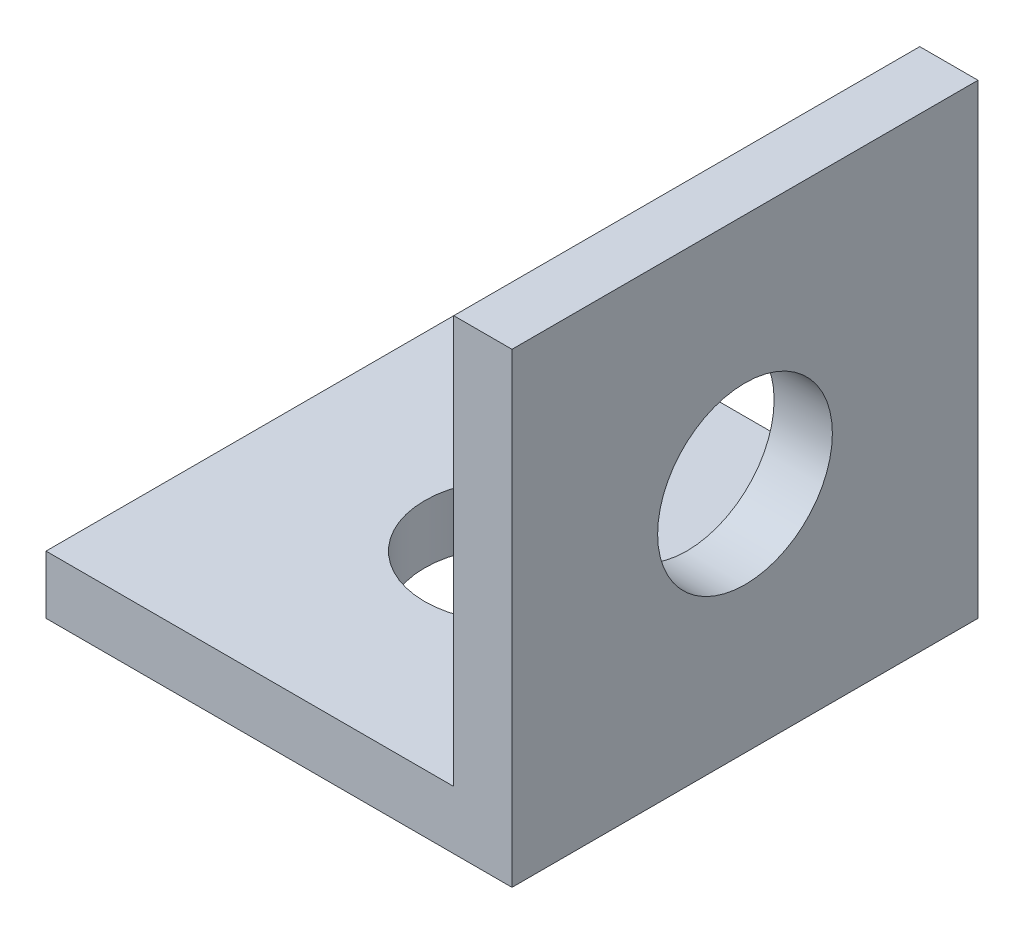
ISO-10303-21;
HEADER;
FILE_DESCRIPTION(('STEP AP214'),'2;1');
FILE_NAME('part.step','',(''),(''),'','','');
FILE_SCHEMA(('AUTOMOTIVE_DESIGN { 1 0 10303 214 1 1 1 1 }'));
ENDSEC;
DATA;
#1=APPLICATION_CONTEXT('core data for automotive mechanical design processes');
#2=APPLICATION_PROTOCOL_DEFINITION('international standard','automotive_design',2000,#1);
#3=PRODUCT_CONTEXT('',#1,'mechanical');
#4=PRODUCT('Part','Part','',(#3));
#5=PRODUCT_RELATED_PRODUCT_CATEGORY('part','',(#4));
#6=PRODUCT_DEFINITION_FORMATION('','',#4);
#7=PRODUCT_DEFINITION_CONTEXT('part definition',#1,'design');
#8=PRODUCT_DEFINITION('design','',#6,#7);
#9=PRODUCT_DEFINITION_SHAPE('','',#8);
#10=(LENGTH_UNIT() NAMED_UNIT(*) SI_UNIT(.MILLI.,.METRE.));
#11=(NAMED_UNIT(*) PLANE_ANGLE_UNIT() SI_UNIT($,.RADIAN.));
#12=(NAMED_UNIT(*) SI_UNIT($,.STERADIAN.) SOLID_ANGLE_UNIT());
#13=UNCERTAINTY_MEASURE_WITH_UNIT(LENGTH_MEASURE(1.E-05),#10,'distance_accuracy_value','');
#14=(GEOMETRIC_REPRESENTATION_CONTEXT(3) GLOBAL_UNCERTAINTY_ASSIGNED_CONTEXT((#13)) GLOBAL_UNIT_ASSIGNED_CONTEXT((#10,
#11,#12)) REPRESENTATION_CONTEXT('',''));
#15=CARTESIAN_POINT('',(0.,0.,0.));
#16=DIRECTION('',(0.,0.,1.));
#17=DIRECTION('',(1.,0.,0.));
#18=AXIS2_PLACEMENT_3D('',#15,#16,#17);
#19=CARTESIAN_POINT('',(0.,1.,-8.));
#20=DIRECTION('',(0.,-1.,0.));
#21=DIRECTION('',(0.,0.,-1.));
#22=AXIS2_PLACEMENT_3D('',#19,#20,#21);
#23=PLANE('',#22);
#24=CARTESIAN_POINT('',(4.,1.,-4.));
#25=DIRECTION('',(0.,1.,0.));
#26=DIRECTION('',(0.,0.,1.));
#27=AXIS2_PLACEMENT_3D('',#24,#25,#26);
#28=CIRCLE('',#27,1.5);
#29=CARTESIAN_POINT('',(4.,1.,-2.5));
#30=VERTEX_POINT('',#29);
#31=EDGE_CURVE('E95',#30,#30,#28,.T.);
#32=ORIENTED_EDGE('',*,*,#31,.F.);
#33=EDGE_LOOP('',(#32));
#34=FACE_BOUND('',#33,.T.);
#35=DIRECTION('',(0.,0.,1.));
#36=VECTOR('',#35,1.);
#37=CARTESIAN_POINT('',(7.,1.,0.));
#38=LINE('',#37,#36);
#39=CARTESIAN_POINT('',(7.,1.,-8.));
#40=VERTEX_POINT('',#39);
#41=CARTESIAN_POINT('',(7.,1.,0.));
#42=VERTEX_POINT('',#41);
#43=EDGE_CURVE('E48',#40,#42,#38,.T.);
#44=ORIENTED_EDGE('',*,*,#43,.F.);
#45=DIRECTION('',(-1.,0.,0.));
#46=VECTOR('',#45,1.);
#47=CARTESIAN_POINT('',(0.,1.,-8.));
#48=LINE('',#47,#46);
#49=CARTESIAN_POINT('',(0.,1.,-8.));
#50=VERTEX_POINT('',#49);
#51=EDGE_CURVE('E53',#40,#50,#48,.T.);
#52=ORIENTED_EDGE('',*,*,#51,.T.);
#53=DIRECTION('',(0.,0.,1.));
#54=VECTOR('',#53,1.);
#55=CARTESIAN_POINT('',(0.,1.,0.));
#56=LINE('',#55,#54);
#57=CARTESIAN_POINT('',(0.,1.,0.));
#58=VERTEX_POINT('',#57);
#59=EDGE_CURVE('E84',#50,#58,#56,.T.);
#60=ORIENTED_EDGE('',*,*,#59,.T.);
#61=DIRECTION('',(1.,0.,0.));
#62=VECTOR('',#61,1.);
#63=CARTESIAN_POINT('',(0.,1.,0.));
#64=LINE('',#63,#62);
#65=EDGE_CURVE('E109',#58,#42,#64,.T.);
#66=ORIENTED_EDGE('',*,*,#65,.T.);
#67=EDGE_LOOP('',(#44,#52,#60,#66));
#68=FACE_BOUND('',#67,.T.);
#69=ADVANCED_FACE('F31',(#34,#68),#23,.F.);
#70=CARTESIAN_POINT('',(0.,0.,-8.));
#71=DIRECTION('',(0.,-1.,0.));
#72=DIRECTION('',(0.,0.,-1.));
#73=AXIS2_PLACEMENT_3D('',#70,#71,#72);
#74=PLANE('',#73);
#75=DIRECTION('',(0.,0.,1.));
#76=VECTOR('',#75,1.);
#77=CARTESIAN_POINT('',(0.,0.,0.));
#78=LINE('',#77,#76);
#79=CARTESIAN_POINT('',(0.,0.,-8.));
#80=VERTEX_POINT('',#79);
#81=CARTESIAN_POINT('',(0.,0.,0.));
#82=VERTEX_POINT('',#81);
#83=EDGE_CURVE('E90',#80,#82,#78,.T.);
#84=ORIENTED_EDGE('',*,*,#83,.F.);
#85=DIRECTION('',(-1.,0.,0.));
#86=VECTOR('',#85,1.);
#87=CARTESIAN_POINT('',(0.,0.,-8.));
#88=LINE('',#87,#86);
#89=CARTESIAN_POINT('',(8.,0.,-8.));
#90=VERTEX_POINT('',#89);
#91=EDGE_CURVE('E73',#90,#80,#88,.T.);
#92=ORIENTED_EDGE('',*,*,#91,.F.);
#93=DIRECTION('',(0.,0.,-1.));
#94=VECTOR('',#93,1.);
#95=CARTESIAN_POINT('',(8.,0.,0.));
#96=LINE('',#95,#94);
#97=CARTESIAN_POINT('',(8.,0.,0.));
#98=VERTEX_POINT('',#97);
#99=EDGE_CURVE('E85',#98,#90,#96,.T.);
#100=ORIENTED_EDGE('',*,*,#99,.F.);
#101=DIRECTION('',(1.,0.,0.));
#102=VECTOR('',#101,1.);
#103=CARTESIAN_POINT('',(0.,0.,0.));
#104=LINE('',#103,#102);
#105=EDGE_CURVE('E94',#82,#98,#104,.T.);
#106=ORIENTED_EDGE('',*,*,#105,.F.);
#107=EDGE_LOOP('',(#84,#92,#100,#106));
#108=FACE_BOUND('',#107,.T.);
#109=CARTESIAN_POINT('',(4.,0.,-4.));
#110=DIRECTION('',(0.,1.,0.));
#111=DIRECTION('',(0.,0.,1.));
#112=AXIS2_PLACEMENT_3D('',#109,#110,#111);
#113=CIRCLE('',#112,1.5);
#114=CARTESIAN_POINT('',(4.,0.,-2.5));
#115=VERTEX_POINT('',#114);
#116=EDGE_CURVE('E99',#115,#115,#113,.T.);
#117=ORIENTED_EDGE('',*,*,#116,.T.);
#118=EDGE_LOOP('',(#117));
#119=FACE_BOUND('',#118,.T.);
#120=ADVANCED_FACE('F92',(#108,#119),#74,.T.);
#121=CARTESIAN_POINT('',(0.,1.,0.));
#122=DIRECTION('',(1.,0.,0.));
#123=DIRECTION('',(0.,0.,-1.));
#124=AXIS2_PLACEMENT_3D('',#121,#122,#123);
#125=PLANE('',#124);
#126=ORIENTED_EDGE('',*,*,#83,.T.);
#127=DIRECTION('',(0.,-1.,0.));
#128=VECTOR('',#127,1.);
#129=CARTESIAN_POINT('',(0.,1.,0.));
#130=LINE('',#129,#128);
#131=EDGE_CURVE('E11',#58,#82,#130,.T.);
#132=ORIENTED_EDGE('',*,*,#131,.F.);
#133=ORIENTED_EDGE('',*,*,#59,.F.);
#134=DIRECTION('',(0.,-1.,0.));
#135=VECTOR('',#134,1.);
#136=CARTESIAN_POINT('',(0.,1.,-8.));
#137=LINE('',#136,#135);
#138=EDGE_CURVE('E76',#50,#80,#137,.T.);
#139=ORIENTED_EDGE('',*,*,#138,.T.);
#140=EDGE_LOOP('',(#126,#132,#133,#139));
#141=FACE_BOUND('',#140,.T.);
#142=ADVANCED_FACE('F33',(#141),#125,.F.);
#143=CARTESIAN_POINT('',(0.,1.,0.));
#144=DIRECTION('',(0.,0.,-1.));
#145=DIRECTION('',(-1.,0.,0.));
#146=AXIS2_PLACEMENT_3D('',#143,#144,#145);
#147=PLANE('',#146);
#148=ORIENTED_EDGE('',*,*,#105,.T.);
#149=DIRECTION('',(0.,-1.,0.));
#150=VECTOR('',#149,1.);
#151=CARTESIAN_POINT('',(8.,1.,0.));
#152=LINE('',#151,#150);
#153=CARTESIAN_POINT('',(8.,8.,0.));
#154=VERTEX_POINT('',#153);
#155=EDGE_CURVE('E40',#154,#98,#152,.T.);
#156=ORIENTED_EDGE('',*,*,#155,.F.);
#157=DIRECTION('',(1.,0.,0.));
#158=VECTOR('',#157,1.);
#159=CARTESIAN_POINT('',(8.,8.,0.));
#160=LINE('',#159,#158);
#161=CARTESIAN_POINT('',(7.,8.,0.));
#162=VERTEX_POINT('',#161);
#163=EDGE_CURVE('E120',#162,#154,#160,.T.);
#164=ORIENTED_EDGE('',*,*,#163,.F.);
#165=DIRECTION('',(0.,-1.,0.));
#166=VECTOR('',#165,1.);
#167=CARTESIAN_POINT('',(7.,8.,0.));
#168=LINE('',#167,#166);
#169=EDGE_CURVE('E125',#162,#42,#168,.T.);
#170=ORIENTED_EDGE('',*,*,#169,.T.);
#171=ORIENTED_EDGE('',*,*,#65,.F.);
#172=ORIENTED_EDGE('',*,*,#131,.T.);
#173=EDGE_LOOP('',(#148,#156,#164,#170,#171,#172));
#174=FACE_BOUND('',#173,.T.);
#175=ADVANCED_FACE('F151',(#174),#147,.F.);
#176=CARTESIAN_POINT('',(8.,1.,0.));
#177=DIRECTION('',(-1.,0.,0.));
#178=DIRECTION('',(0.,0.,1.));
#179=AXIS2_PLACEMENT_3D('',#176,#177,#178);
#180=PLANE('',#179);
#181=CARTESIAN_POINT('',(8.,4.,-4.));
#182=DIRECTION('',(1.,0.,0.));
#183=DIRECTION('',(0.,0.,-1.));
#184=AXIS2_PLACEMENT_3D('',#181,#182,#183);
#185=CIRCLE('',#184,1.5);
#186=CARTESIAN_POINT('',(8.,4.,-5.5));
#187=VERTEX_POINT('',#186);
#188=EDGE_CURVE('E160',#187,#187,#185,.T.);
#189=ORIENTED_EDGE('',*,*,#188,.F.);
#190=EDGE_LOOP('',(#189));
#191=FACE_BOUND('',#190,.T.);
#192=ORIENTED_EDGE('',*,*,#99,.T.);
#193=DIRECTION('',(0.,-1.,0.));
#194=VECTOR('',#193,1.);
#195=CARTESIAN_POINT('',(8.,1.,-8.));
#196=LINE('',#195,#194);
#197=CARTESIAN_POINT('',(8.,8.,-8.));
#198=VERTEX_POINT('',#197);
#199=EDGE_CURVE('E80',#198,#90,#196,.T.);
#200=ORIENTED_EDGE('',*,*,#199,.F.);
#201=DIRECTION('',(0.,0.,-1.));
#202=VECTOR('',#201,1.);
#203=CARTESIAN_POINT('',(8.,8.,0.));
#204=LINE('',#203,#202);
#205=EDGE_CURVE('E123',#154,#198,#204,.T.);
#206=ORIENTED_EDGE('',*,*,#205,.F.);
#207=ORIENTED_EDGE('',*,*,#155,.T.);
#208=EDGE_LOOP('',(#192,#200,#206,#207));
#209=FACE_BOUND('',#208,.T.);
#210=ADVANCED_FACE('F167',(#191,#209),#180,.F.);
#211=CARTESIAN_POINT('',(0.,1.,-8.));
#212=DIRECTION('',(0.,0.,1.));
#213=DIRECTION('',(1.,0.,0.));
#214=AXIS2_PLACEMENT_3D('',#211,#212,#213);
#215=PLANE('',#214);
#216=ORIENTED_EDGE('',*,*,#91,.T.);
#217=ORIENTED_EDGE('',*,*,#138,.F.);
#218=ORIENTED_EDGE('',*,*,#51,.F.);
#219=DIRECTION('',(0.,-1.,0.));
#220=VECTOR('',#219,1.);
#221=CARTESIAN_POINT('',(7.,8.,-8.));
#222=LINE('',#221,#220);
#223=CARTESIAN_POINT('',(7.,8.,-8.));
#224=VERTEX_POINT('',#223);
#225=EDGE_CURVE('E116',#224,#40,#222,.T.);
#226=ORIENTED_EDGE('',*,*,#225,.F.);
#227=DIRECTION('',(-1.,0.,0.));
#228=VECTOR('',#227,1.);
#229=CARTESIAN_POINT('',(8.,8.,-8.));
#230=LINE('',#229,#228);
#231=EDGE_CURVE('E141',#198,#224,#230,.T.);
#232=ORIENTED_EDGE('',*,*,#231,.F.);
#233=ORIENTED_EDGE('',*,*,#199,.T.);
#234=EDGE_LOOP('',(#216,#217,#218,#226,#232,#233));
#235=FACE_BOUND('',#234,.T.);
#236=ADVANCED_FACE('F75',(#235),#215,.F.);
#237=CARTESIAN_POINT('',(4.,1.,-4.));
#238=DIRECTION('',(0.,-1.,0.));
#239=DIRECTION('',(0.,0.,-1.));
#240=AXIS2_PLACEMENT_3D('',#237,#238,#239);
#241=CYLINDRICAL_SURFACE('',#240,1.5);
#242=ORIENTED_EDGE('',*,*,#31,.T.);
#243=EDGE_LOOP('',(#242));
#244=FACE_BOUND('',#243,.T.);
#245=ORIENTED_EDGE('',*,*,#116,.F.);
#246=EDGE_LOOP('',(#245));
#247=FACE_BOUND('',#246,.T.);
#248=ADVANCED_FACE('F179',(#244,#247),#241,.F.);
#249=CARTESIAN_POINT('',(7.,8.,0.));
#250=DIRECTION('',(1.,0.,0.));
#251=DIRECTION('',(0.,0.,-1.));
#252=AXIS2_PLACEMENT_3D('',#249,#250,#251);
#253=PLANE('',#252);
#254=CARTESIAN_POINT('',(7.,4.,-4.));
#255=DIRECTION('',(1.,0.,0.));
#256=DIRECTION('',(0.,0.,-1.));
#257=AXIS2_PLACEMENT_3D('',#254,#255,#256);
#258=CIRCLE('',#257,1.5);
#259=CARTESIAN_POINT('',(7.,4.,-5.5));
#260=VERTEX_POINT('',#259);
#261=EDGE_CURVE('E124',#260,#260,#258,.F.);
#262=ORIENTED_EDGE('',*,*,#261,.F.);
#263=EDGE_LOOP('',(#262));
#264=FACE_BOUND('',#263,.T.);
#265=ORIENTED_EDGE('',*,*,#43,.T.);
#266=ORIENTED_EDGE('',*,*,#169,.F.);
#267=DIRECTION('',(0.,0.,1.));
#268=VECTOR('',#267,1.);
#269=CARTESIAN_POINT('',(7.,8.,0.));
#270=LINE('',#269,#268);
#271=EDGE_CURVE('E138',#224,#162,#270,.T.);
#272=ORIENTED_EDGE('',*,*,#271,.F.);
#273=ORIENTED_EDGE('',*,*,#225,.T.);
#274=EDGE_LOOP('',(#265,#266,#272,#273));
#275=FACE_BOUND('',#274,.T.);
#276=ADVANCED_FACE('F133',(#264,#275),#253,.F.);
#277=CARTESIAN_POINT('',(8.,8.,-8.));
#278=DIRECTION('',(0.,1.,0.));
#279=DIRECTION('',(0.,0.,1.));
#280=AXIS2_PLACEMENT_3D('',#277,#278,#279);
#281=PLANE('',#280);
#282=ORIENTED_EDGE('',*,*,#205,.T.);
#283=ORIENTED_EDGE('',*,*,#231,.T.);
#284=ORIENTED_EDGE('',*,*,#271,.T.);
#285=ORIENTED_EDGE('',*,*,#163,.T.);
#286=EDGE_LOOP('',(#282,#283,#284,#285));
#287=FACE_BOUND('',#286,.T.);
#288=ADVANCED_FACE('F171',(#287),#281,.T.);
#289=CARTESIAN_POINT('',(-0.00102499999999998,4.,-4.));
#290=DIRECTION('',(1.,0.,0.));
#291=DIRECTION('',(0.,0.,-1.));
#292=AXIS2_PLACEMENT_3D('',#289,#290,#291);
#293=CYLINDRICAL_SURFACE('',#292,1.5);
#294=ORIENTED_EDGE('',*,*,#188,.T.);
#295=EDGE_LOOP('',(#294));
#296=FACE_BOUND('',#295,.T.);
#297=ORIENTED_EDGE('',*,*,#261,.T.);
#298=EDGE_LOOP('',(#297));
#299=FACE_BOUND('',#298,.T.);
#300=ADVANCED_FACE('F164',(#296,#299),#293,.F.);
#301=CLOSED_SHELL('',(#69,#120,#142,#175,#210,#236,#248,#276,#288,#300));
#302=MANIFOLD_SOLID_BREP('B2',#301);
#303=ADVANCED_BREP_SHAPE_REPRESENTATION('',(#18,#302),#14);
#304=SHAPE_DEFINITION_REPRESENTATION(#9,#303);
ENDSEC;
END-ISO-10303-21;
